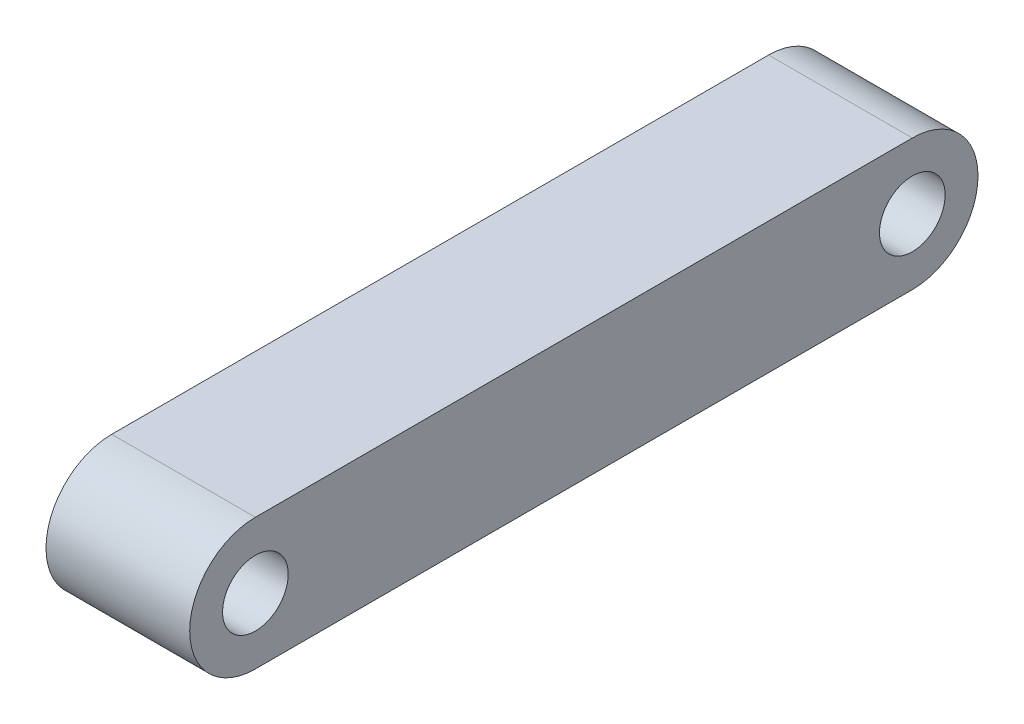
ISO-10303-21;
HEADER;
FILE_DESCRIPTION(('STEP AP214'),'2;1');
FILE_NAME('part.step','',(''),(''),'','','');
FILE_SCHEMA(('AUTOMOTIVE_DESIGN { 1 0 10303 214 1 1 1 1 }'));
ENDSEC;
DATA;
#1=APPLICATION_CONTEXT('core data for automotive mechanical design processes');
#2=APPLICATION_PROTOCOL_DEFINITION('international standard','automotive_design',2000,#1);
#3=PRODUCT_CONTEXT('',#1,'mechanical');
#4=PRODUCT('Part','Part','',(#3));
#5=PRODUCT_RELATED_PRODUCT_CATEGORY('part','',(#4));
#6=PRODUCT_DEFINITION_FORMATION('','',#4);
#7=PRODUCT_DEFINITION_CONTEXT('part definition',#1,'design');
#8=PRODUCT_DEFINITION('design','',#6,#7);
#9=PRODUCT_DEFINITION_SHAPE('','',#8);
#10=(LENGTH_UNIT() NAMED_UNIT(*) SI_UNIT(.MILLI.,.METRE.));
#11=(NAMED_UNIT(*) PLANE_ANGLE_UNIT() SI_UNIT($,.RADIAN.));
#12=(NAMED_UNIT(*) SI_UNIT($,.STERADIAN.) SOLID_ANGLE_UNIT());
#13=UNCERTAINTY_MEASURE_WITH_UNIT(LENGTH_MEASURE(1.E-05),#10,'distance_accuracy_value','');
#14=(GEOMETRIC_REPRESENTATION_CONTEXT(3) GLOBAL_UNCERTAINTY_ASSIGNED_CONTEXT((#13)) GLOBAL_UNIT_ASSIGNED_CONTEXT((#10,
#11,#12)) REPRESENTATION_CONTEXT('',''));
#15=CARTESIAN_POINT('',(0.,0.,0.));
#16=DIRECTION('',(0.,0.,1.));
#17=DIRECTION('',(1.,0.,0.));
#18=AXIS2_PLACEMENT_3D('',#15,#16,#17);
#19=CARTESIAN_POINT('',(17.5,-7.99999999999999,0.));
#20=DIRECTION('',(0.,1.,0.));
#21=DIRECTION('',(0.,0.,1.));
#22=AXIS2_PLACEMENT_3D('',#19,#20,#21);
#23=PLANE('',#22);
#24=DIRECTION('',(0.,0.,-1.));
#25=VECTOR('',#24,1.);
#26=CARTESIAN_POINT('',(0.,-7.99999999999999,0.));
#27=LINE('',#26,#25);
#28=CARTESIAN_POINT('',(0.,-7.99999999999999,40.));
#29=VERTEX_POINT('',#28);
#30=CARTESIAN_POINT('',(0.,-7.99999999999999,-40.));
#31=VERTEX_POINT('',#30);
#32=EDGE_CURVE('E107',#29,#31,#27,.T.);
#33=ORIENTED_EDGE('',*,*,#32,.T.);
#34=DIRECTION('',(-1.,0.,0.));
#35=VECTOR('',#34,1.);
#36=CARTESIAN_POINT('',(17.5,-7.99999999999999,-40.));
#37=LINE('',#36,#35);
#38=CARTESIAN_POINT('',(17.5,-7.99999999999999,-40.));
#39=VERTEX_POINT('',#38);
#40=EDGE_CURVE('E11',#39,#31,#37,.T.);
#41=ORIENTED_EDGE('',*,*,#40,.F.);
#42=DIRECTION('',(0.,0.,-1.));
#43=VECTOR('',#42,1.);
#44=CARTESIAN_POINT('',(17.5,-7.99999999999999,0.));
#45=LINE('',#44,#43);
#46=CARTESIAN_POINT('',(17.5,-7.99999999999999,40.));
#47=VERTEX_POINT('',#46);
#48=EDGE_CURVE('E87',#47,#39,#45,.T.);
#49=ORIENTED_EDGE('',*,*,#48,.F.);
#50=DIRECTION('',(-1.,0.,0.));
#51=VECTOR('',#50,1.);
#52=CARTESIAN_POINT('',(17.5,-7.99999999999999,40.));
#53=LINE('',#52,#51);
#54=EDGE_CURVE('E54',#47,#29,#53,.T.);
#55=ORIENTED_EDGE('',*,*,#54,.T.);
#56=EDGE_LOOP('',(#33,#41,#49,#55));
#57=FACE_BOUND('',#56,.T.);
#58=ADVANCED_FACE('F37',(#57),#23,.F.);
#59=CARTESIAN_POINT('',(17.5,0.,-40.));
#60=DIRECTION('',(-1.,0.,0.));
#61=DIRECTION('',(0.,0.,1.));
#62=AXIS2_PLACEMENT_3D('',#59,#60,#61);
#63=CYLINDRICAL_SURFACE('',#62,7.99999999999999);
#64=CARTESIAN_POINT('',(0.,0.,-40.));
#65=DIRECTION('',(1.,0.,0.));
#66=DIRECTION('',(0.,0.,-1.));
#67=AXIS2_PLACEMENT_3D('',#64,#65,#66);
#68=CIRCLE('',#67,7.99999999999999);
#69=CARTESIAN_POINT('',(0.,7.99999999999998,-40.));
#70=VERTEX_POINT('',#69);
#71=EDGE_CURVE('E92',#31,#70,#68,.T.);
#72=ORIENTED_EDGE('',*,*,#71,.T.);
#73=DIRECTION('',(-1.,0.,0.));
#74=VECTOR('',#73,1.);
#75=CARTESIAN_POINT('',(17.5,7.99999999999998,-40.));
#76=LINE('',#75,#74);
#77=CARTESIAN_POINT('',(17.5,7.99999999999998,-40.));
#78=VERTEX_POINT('',#77);
#79=EDGE_CURVE('E46',#78,#70,#76,.T.);
#80=ORIENTED_EDGE('',*,*,#79,.F.);
#81=CARTESIAN_POINT('',(17.5,0.,-40.));
#82=DIRECTION('',(1.,0.,0.));
#83=DIRECTION('',(0.,0.,-1.));
#84=AXIS2_PLACEMENT_3D('',#81,#82,#83);
#85=CIRCLE('',#84,7.99999999999999);
#86=EDGE_CURVE('E79',#39,#78,#85,.T.);
#87=ORIENTED_EDGE('',*,*,#86,.F.);
#88=ORIENTED_EDGE('',*,*,#40,.T.);
#89=EDGE_LOOP('',(#72,#80,#87,#88));
#90=FACE_BOUND('',#89,.T.);
#91=ADVANCED_FACE('F91',(#90),#63,.T.);
#92=CARTESIAN_POINT('',(17.5,7.99999999999998,0.));
#93=DIRECTION('',(0.,1.,0.));
#94=DIRECTION('',(0.,0.,1.));
#95=AXIS2_PLACEMENT_3D('',#92,#93,#94);
#96=PLANE('',#95);
#97=DIRECTION('',(0.,0.,-1.));
#98=VECTOR('',#97,1.);
#99=CARTESIAN_POINT('',(0.,7.99999999999998,0.));
#100=LINE('',#99,#98);
#101=CARTESIAN_POINT('',(0.,7.99999999999998,40.));
#102=VERTEX_POINT('',#101);
#103=EDGE_CURVE('E110',#102,#70,#100,.T.);
#104=ORIENTED_EDGE('',*,*,#103,.F.);
#105=DIRECTION('',(-1.,0.,0.));
#106=VECTOR('',#105,1.);
#107=CARTESIAN_POINT('',(17.5,7.99999999999998,40.));
#108=LINE('',#107,#106);
#109=CARTESIAN_POINT('',(17.5,7.99999999999998,40.));
#110=VERTEX_POINT('',#109);
#111=EDGE_CURVE('E68',#110,#102,#108,.T.);
#112=ORIENTED_EDGE('',*,*,#111,.F.);
#113=DIRECTION('',(0.,0.,-1.));
#114=VECTOR('',#113,1.);
#115=CARTESIAN_POINT('',(17.5,7.99999999999998,0.));
#116=LINE('',#115,#114);
#117=EDGE_CURVE('E86',#110,#78,#116,.T.);
#118=ORIENTED_EDGE('',*,*,#117,.T.);
#119=ORIENTED_EDGE('',*,*,#79,.T.);
#120=EDGE_LOOP('',(#104,#112,#118,#119));
#121=FACE_BOUND('',#120,.T.);
#122=ADVANCED_FACE('F95',(#121),#96,.T.);
#123=CARTESIAN_POINT('',(17.5,0.,40.));
#124=DIRECTION('',(-1.,0.,0.));
#125=DIRECTION('',(0.,0.,1.));
#126=AXIS2_PLACEMENT_3D('',#123,#124,#125);
#127=CYLINDRICAL_SURFACE('',#126,4.00000000000001);
#128=CARTESIAN_POINT('',(17.5,0.,40.));
#129=DIRECTION('',(1.,0.,0.));
#130=DIRECTION('',(0.,0.,-1.));
#131=AXIS2_PLACEMENT_3D('',#128,#129,#130);
#132=CIRCLE('',#131,4.00000000000001);
#133=CARTESIAN_POINT('',(17.5,0.,36.));
#134=VERTEX_POINT('',#133);
#135=EDGE_CURVE('E119',#134,#134,#132,.T.);
#136=ORIENTED_EDGE('',*,*,#135,.T.);
#137=EDGE_LOOP('',(#136));
#138=FACE_BOUND('',#137,.T.);
#139=CARTESIAN_POINT('',(0.,0.,40.));
#140=DIRECTION('',(1.,0.,0.));
#141=DIRECTION('',(0.,0.,-1.));
#142=AXIS2_PLACEMENT_3D('',#139,#140,#141);
#143=CIRCLE('',#142,4.00000000000001);
#144=CARTESIAN_POINT('',(0.,0.,36.));
#145=VERTEX_POINT('',#144);
#146=EDGE_CURVE('E104',#145,#145,#143,.T.);
#147=ORIENTED_EDGE('',*,*,#146,.F.);
#148=EDGE_LOOP('',(#147));
#149=FACE_BOUND('',#148,.T.);
#150=ADVANCED_FACE('F127',(#138,#149),#127,.F.);
#151=CARTESIAN_POINT('',(17.5,0.,-40.));
#152=DIRECTION('',(-1.,0.,0.));
#153=DIRECTION('',(0.,0.,1.));
#154=AXIS2_PLACEMENT_3D('',#151,#152,#153);
#155=CYLINDRICAL_SURFACE('',#154,4.00000000000001);
#156=CARTESIAN_POINT('',(17.5,0.,-40.));
#157=DIRECTION('',(1.,0.,0.));
#158=DIRECTION('',(0.,0.,-1.));
#159=AXIS2_PLACEMENT_3D('',#156,#157,#158);
#160=CIRCLE('',#159,4.00000000000001);
#161=CARTESIAN_POINT('',(17.5,0.,-44.));
#162=VERTEX_POINT('',#161);
#163=EDGE_CURVE('E115',#162,#162,#160,.F.);
#164=ORIENTED_EDGE('',*,*,#163,.F.);
#165=EDGE_LOOP('',(#164));
#166=FACE_BOUND('',#165,.T.);
#167=CARTESIAN_POINT('',(0.,0.,-40.));
#168=DIRECTION('',(1.,0.,0.));
#169=DIRECTION('',(0.,0.,-1.));
#170=AXIS2_PLACEMENT_3D('',#167,#168,#169);
#171=CIRCLE('',#170,4.00000000000001);
#172=CARTESIAN_POINT('',(0.,0.,-44.));
#173=VERTEX_POINT('',#172);
#174=EDGE_CURVE('E101',#173,#173,#171,.F.);
#175=ORIENTED_EDGE('',*,*,#174,.T.);
#176=EDGE_LOOP('',(#175));
#177=FACE_BOUND('',#176,.T.);
#178=ADVANCED_FACE('F39',(#166,#177),#155,.F.);
#179=CARTESIAN_POINT('',(17.5,0.,40.));
#180=DIRECTION('',(-1.,0.,0.));
#181=DIRECTION('',(0.,0.,1.));
#182=AXIS2_PLACEMENT_3D('',#179,#180,#181);
#183=CYLINDRICAL_SURFACE('',#182,7.99999999999999);
#184=CARTESIAN_POINT('',(0.,0.,40.));
#185=DIRECTION('',(1.,0.,0.));
#186=DIRECTION('',(0.,0.,-1.));
#187=AXIS2_PLACEMENT_3D('',#184,#185,#186);
#188=CIRCLE('',#187,7.99999999999999);
#189=EDGE_CURVE('E112',#29,#102,#188,.F.);
#190=ORIENTED_EDGE('',*,*,#189,.F.);
#191=ORIENTED_EDGE('',*,*,#54,.F.);
#192=CARTESIAN_POINT('',(17.5,0.,40.));
#193=DIRECTION('',(1.,0.,0.));
#194=DIRECTION('',(0.,0.,-1.));
#195=AXIS2_PLACEMENT_3D('',#192,#193,#194);
#196=CIRCLE('',#195,7.99999999999999);
#197=EDGE_CURVE('E96',#47,#110,#196,.F.);
#198=ORIENTED_EDGE('',*,*,#197,.T.);
#199=ORIENTED_EDGE('',*,*,#111,.T.);
#200=EDGE_LOOP('',(#190,#191,#198,#199));
#201=FACE_BOUND('',#200,.T.);
#202=ADVANCED_FACE('F132',(#201),#183,.T.);
#203=CARTESIAN_POINT('',(17.5,0.,0.));
#204=DIRECTION('',(1.,0.,0.));
#205=DIRECTION('',(0.,0.,-1.));
#206=AXIS2_PLACEMENT_3D('',#203,#204,#205);
#207=PLANE('',#206);
#208=ORIENTED_EDGE('',*,*,#163,.T.);
#209=EDGE_LOOP('',(#208));
#210=FACE_BOUND('',#209,.T.);
#211=ORIENTED_EDGE('',*,*,#135,.F.);
#212=EDGE_LOOP('',(#211));
#213=FACE_BOUND('',#212,.T.);
#214=ORIENTED_EDGE('',*,*,#48,.T.);
#215=ORIENTED_EDGE('',*,*,#86,.T.);
#216=ORIENTED_EDGE('',*,*,#117,.F.);
#217=ORIENTED_EDGE('',*,*,#197,.F.);
#218=EDGE_LOOP('',(#214,#215,#216,#217));
#219=FACE_BOUND('',#218,.T.);
#220=ADVANCED_FACE('F83',(#210,#213,#219),#207,.T.);
#221=CARTESIAN_POINT('',(0.,0.,0.));
#222=DIRECTION('',(1.,0.,0.));
#223=DIRECTION('',(0.,0.,-1.));
#224=AXIS2_PLACEMENT_3D('',#221,#222,#223);
#225=PLANE('',#224);
#226=ORIENTED_EDGE('',*,*,#174,.F.);
#227=EDGE_LOOP('',(#226));
#228=FACE_BOUND('',#227,.T.);
#229=ORIENTED_EDGE('',*,*,#146,.T.);
#230=EDGE_LOOP('',(#229));
#231=FACE_BOUND('',#230,.T.);
#232=ORIENTED_EDGE('',*,*,#32,.F.);
#233=ORIENTED_EDGE('',*,*,#189,.T.);
#234=ORIENTED_EDGE('',*,*,#103,.T.);
#235=ORIENTED_EDGE('',*,*,#71,.F.);
#236=EDGE_LOOP('',(#232,#233,#234,#235));
#237=FACE_BOUND('',#236,.T.);
#238=ADVANCED_FACE('F131',(#228,#231,#237),#225,.F.);
#239=CLOSED_SHELL('',(#58,#91,#122,#150,#178,#202,#220,#238));
#240=MANIFOLD_SOLID_BREP('B2',#239);
#241=ADVANCED_BREP_SHAPE_REPRESENTATION('',(#18,#240),#14);
#242=SHAPE_DEFINITION_REPRESENTATION(#9,#241);
ENDSEC;
END-ISO-10303-21;
